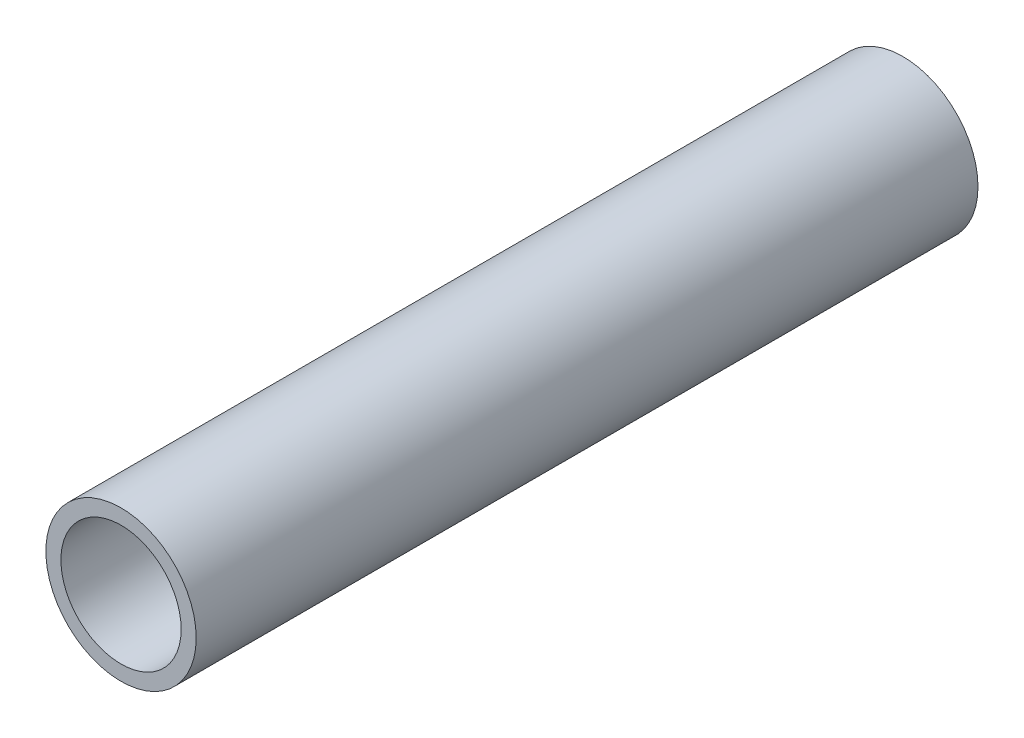
ISO-10303-21;
HEADER;
FILE_DESCRIPTION(('STEP AP214'),'2;1');
FILE_NAME('part.step','',(''),(''),'','','');
FILE_SCHEMA(('AUTOMOTIVE_DESIGN { 1 0 10303 214 1 1 1 1 }'));
ENDSEC;
DATA;
#1=APPLICATION_CONTEXT('core data for automotive mechanical design processes');
#2=APPLICATION_PROTOCOL_DEFINITION('international standard','automotive_design',2000,#1);
#3=PRODUCT_CONTEXT('',#1,'mechanical');
#4=PRODUCT('Part','Part','',(#3));
#5=PRODUCT_RELATED_PRODUCT_CATEGORY('part','',(#4));
#6=PRODUCT_DEFINITION_FORMATION('','',#4);
#7=PRODUCT_DEFINITION_CONTEXT('part definition',#1,'design');
#8=PRODUCT_DEFINITION('design','',#6,#7);
#9=PRODUCT_DEFINITION_SHAPE('','',#8);
#10=(LENGTH_UNIT() NAMED_UNIT(*) SI_UNIT(.MILLI.,.METRE.));
#11=(NAMED_UNIT(*) PLANE_ANGLE_UNIT() SI_UNIT($,.RADIAN.));
#12=(NAMED_UNIT(*) SI_UNIT($,.STERADIAN.) SOLID_ANGLE_UNIT());
#13=UNCERTAINTY_MEASURE_WITH_UNIT(LENGTH_MEASURE(1.E-05),#10,'distance_accuracy_value','');
#14=(GEOMETRIC_REPRESENTATION_CONTEXT(3) GLOBAL_UNCERTAINTY_ASSIGNED_CONTEXT((#13)) GLOBAL_UNIT_ASSIGNED_CONTEXT((#10,
#11,#12)) REPRESENTATION_CONTEXT('',''));
#15=CARTESIAN_POINT('',(0.,0.,0.));
#16=DIRECTION('',(0.,0.,1.));
#17=DIRECTION('',(1.,0.,0.));
#18=AXIS2_PLACEMENT_3D('',#15,#16,#17);
#19=CARTESIAN_POINT('',(0.,0.,13.));
#20=DIRECTION('',(0.,0.,1.));
#21=DIRECTION('',(1.,0.,0.));
#22=AXIS2_PLACEMENT_3D('',#19,#20,#21);
#23=PLANE('',#22);
#24=CARTESIAN_POINT('',(0.,0.,13.));
#25=DIRECTION('',(0.,0.,1.));
#26=DIRECTION('',(1.,0.,0.));
#27=AXIS2_PLACEMENT_3D('',#24,#25,#26);
#28=CIRCLE('',#27,1.25);
#29=CARTESIAN_POINT('',(1.25,0.,13.));
#30=VERTEX_POINT('',#29);
#31=EDGE_CURVE('E10',#30,#30,#28,.T.);
#32=ORIENTED_EDGE('',*,*,#31,.T.);
#33=EDGE_LOOP('',(#32));
#34=FACE_BOUND('',#33,.T.);
#35=CARTESIAN_POINT('',(0.,0.,13.));
#36=DIRECTION('',(0.,0.,1.));
#37=DIRECTION('',(1.,0.,0.));
#38=AXIS2_PLACEMENT_3D('',#35,#36,#37);
#39=CIRCLE('',#38,1.);
#40=CARTESIAN_POINT('',(1.,0.,13.));
#41=VERTEX_POINT('',#40);
#42=EDGE_CURVE('E44',#41,#41,#39,.T.);
#43=ORIENTED_EDGE('',*,*,#42,.F.);
#44=EDGE_LOOP('',(#43));
#45=FACE_BOUND('',#44,.T.);
#46=ADVANCED_FACE('F33',(#34,#45),#23,.T.);
#47=CARTESIAN_POINT('',(0.,0.,0.));
#48=DIRECTION('',(0.,0.,1.));
#49=DIRECTION('',(1.,0.,0.));
#50=AXIS2_PLACEMENT_3D('',#47,#48,#49);
#51=PLANE('',#50);
#52=CARTESIAN_POINT('',(0.,0.,0.));
#53=DIRECTION('',(0.,0.,1.));
#54=DIRECTION('',(1.,0.,0.));
#55=AXIS2_PLACEMENT_3D('',#52,#53,#54);
#56=CIRCLE('',#55,1.25);
#57=CARTESIAN_POINT('',(1.25,0.,0.));
#58=VERTEX_POINT('',#57);
#59=EDGE_CURVE('E37',#58,#58,#56,.T.);
#60=ORIENTED_EDGE('',*,*,#59,.F.);
#61=EDGE_LOOP('',(#60));
#62=FACE_BOUND('',#61,.T.);
#63=CARTESIAN_POINT('',(0.,0.,0.));
#64=DIRECTION('',(0.,0.,1.));
#65=DIRECTION('',(1.,0.,0.));
#66=AXIS2_PLACEMENT_3D('',#63,#64,#65);
#67=CIRCLE('',#66,1.);
#68=CARTESIAN_POINT('',(1.,0.,0.));
#69=VERTEX_POINT('',#68);
#70=EDGE_CURVE('E46',#69,#69,#67,.T.);
#71=ORIENTED_EDGE('',*,*,#70,.T.);
#72=EDGE_LOOP('',(#71));
#73=FACE_BOUND('',#72,.T.);
#74=ADVANCED_FACE('F56',(#62,#73),#51,.F.);
#75=CARTESIAN_POINT('',(0.,0.,13.));
#76=DIRECTION('',(0.,0.,-1.));
#77=DIRECTION('',(-1.,0.,0.));
#78=AXIS2_PLACEMENT_3D('',#75,#76,#77);
#79=CYLINDRICAL_SURFACE('',#78,1.25);
#80=ORIENTED_EDGE('',*,*,#31,.F.);
#81=EDGE_LOOP('',(#80));
#82=FACE_BOUND('',#81,.T.);
#83=ORIENTED_EDGE('',*,*,#59,.T.);
#84=EDGE_LOOP('',(#83));
#85=FACE_BOUND('',#84,.T.);
#86=ADVANCED_FACE('F35',(#82,#85),#79,.T.);
#87=CARTESIAN_POINT('',(0.,0.,13.));
#88=DIRECTION('',(0.,0.,-1.));
#89=DIRECTION('',(-1.,0.,0.));
#90=AXIS2_PLACEMENT_3D('',#87,#88,#89);
#91=CYLINDRICAL_SURFACE('',#90,1.);
#92=ORIENTED_EDGE('',*,*,#42,.T.);
#93=EDGE_LOOP('',(#92));
#94=FACE_BOUND('',#93,.T.);
#95=ORIENTED_EDGE('',*,*,#70,.F.);
#96=EDGE_LOOP('',(#95));
#97=FACE_BOUND('',#96,.T.);
#98=ADVANCED_FACE('F52',(#94,#97),#91,.F.);
#99=CLOSED_SHELL('',(#46,#74,#86,#98));
#100=MANIFOLD_SOLID_BREP('B2',#99);
#101=ADVANCED_BREP_SHAPE_REPRESENTATION('',(#18,#100),#14);
#102=SHAPE_DEFINITION_REPRESENTATION(#9,#101);
ENDSEC;
END-ISO-10303-21;
